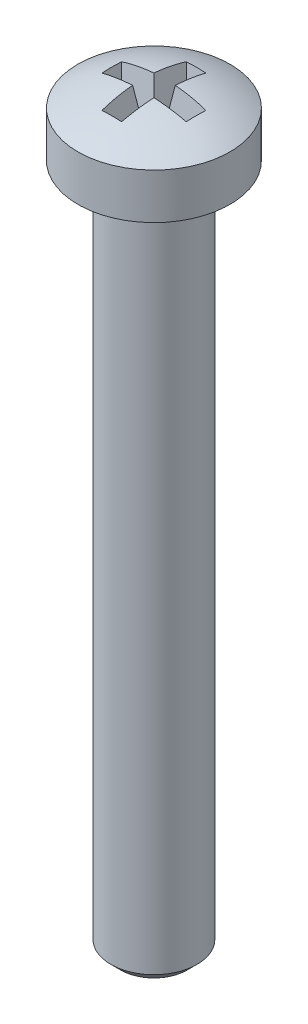
ISO-10303-21;
HEADER;
FILE_DESCRIPTION(('STEP AP214'),'2;1');
FILE_NAME('part.step','',(''),(''),'','','');
FILE_SCHEMA(('AUTOMOTIVE_DESIGN { 1 0 10303 214 1 1 1 1 }'));
ENDSEC;
DATA;
#1=APPLICATION_CONTEXT('core data for automotive mechanical design processes');
#2=APPLICATION_PROTOCOL_DEFINITION('international standard','automotive_design',2000,#1);
#3=PRODUCT_CONTEXT('',#1,'mechanical');
#4=PRODUCT('Part','Part','',(#3));
#5=PRODUCT_RELATED_PRODUCT_CATEGORY('part','',(#4));
#6=PRODUCT_DEFINITION_FORMATION('','',#4);
#7=PRODUCT_DEFINITION_CONTEXT('part definition',#1,'design');
#8=PRODUCT_DEFINITION('design','',#6,#7);
#9=PRODUCT_DEFINITION_SHAPE('','',#8);
#10=(LENGTH_UNIT() NAMED_UNIT(*) SI_UNIT(.MILLI.,.METRE.));
#11=(NAMED_UNIT(*) PLANE_ANGLE_UNIT() SI_UNIT($,.RADIAN.));
#12=(NAMED_UNIT(*) SI_UNIT($,.STERADIAN.) SOLID_ANGLE_UNIT());
#13=UNCERTAINTY_MEASURE_WITH_UNIT(LENGTH_MEASURE(1.E-05),#10,'distance_accuracy_value','');
#14=(GEOMETRIC_REPRESENTATION_CONTEXT(3) GLOBAL_UNCERTAINTY_ASSIGNED_CONTEXT((#13)) GLOBAL_UNIT_ASSIGNED_CONTEXT((#10,
#11,#12)) REPRESENTATION_CONTEXT('',''));
#15=CARTESIAN_POINT('',(0.,0.,0.));
#16=DIRECTION('',(0.,0.,1.));
#17=DIRECTION('',(1.,0.,0.));
#18=AXIS2_PLACEMENT_3D('',#15,#16,#17);
#19=CARTESIAN_POINT('',(6.,9.8,-3.3));
#20=DIRECTION('',(0.,1.,0.));
#21=DIRECTION('',(0.,0.,1.));
#22=AXIS2_PLACEMENT_3D('',#19,#20,#21);
#23=SPHERICAL_SURFACE('',#22,3.);
#24=CARTESIAN_POINT('',(6.,12.3980762113533,-3.3));
#25=DIRECTION('',(0.,1.,0.));
#26=DIRECTION('',(-1.,0.,0.));
#27=AXIS2_PLACEMENT_3D('',#24,#25,#26);
#28=CIRCLE('',#27,1.5);
#29=CARTESIAN_POINT('',(4.5,12.3980762113533,-3.3));
#30=VERTEX_POINT('',#29);
#31=EDGE_CURVE('E160',#30,#30,#28,.T.);
#32=ORIENTED_EDGE('',*,*,#31,.T.);
#33=EDGE_LOOP('',(#32));
#34=FACE_BOUND('',#33,.T.);
#35=CARTESIAN_POINT('',(6.,9.74139917848052,-3.68773769788637));
#36=DIRECTION('',(0.,-0.149438132473599,-0.988771077936042));
#37=DIRECTION('',(0.,0.988771077936042,-0.149438132473599));
#38=AXIS2_PLACEMENT_3D('',#35,#36,#37);
#39=CIRCLE('',#38,2.97426048310416);
#40=CARTESIAN_POINT('',(6.19376146307784,12.6760147557736,-4.13126146307783));
#41=VERTEX_POINT('',#40);
#42=CARTESIAN_POINT('',(5.80623853692217,12.6760147557736,-4.13126146307783));
#43=VERTEX_POINT('',#42);
#44=EDGE_CURVE('E10',#41,#43,#39,.F.);
#45=ORIENTED_EDGE('',*,*,#44,.F.);
#46=CARTESIAN_POINT('',(5.76447419197759,9.83559624435383,-3.3));
#47=DIRECTION('',(0.988771077936042,-0.149438132473599,0.));
#48=DIRECTION('',(0.149438132473599,0.988771077936042,0.));
#49=AXIS2_PLACEMENT_3D('',#46,#47,#48);
#50=CIRCLE('',#49,2.99052846519529);
#51=CARTESIAN_POINT('',(6.21026715799329,12.7852261965451,-3.51026715799328));
#52=VERTEX_POINT('',#51);
#53=EDGE_CURVE('E24',#52,#41,#50,.F.);
#54=ORIENTED_EDGE('',*,*,#53,.F.);
#55=CARTESIAN_POINT('',(6.,9.83559624435383,-3.06447419197759));
#56=DIRECTION('',(0.,-0.149438132473599,-0.988771077936042));
#57=DIRECTION('',(0.,0.988771077936042,-0.149438132473599));
#58=AXIS2_PLACEMENT_3D('',#55,#56,#57);
#59=CIRCLE('',#58,2.99052846519529);
#60=CARTESIAN_POINT('',(6.83126146307784,12.6760147557736,-3.49376146307783));
#61=VERTEX_POINT('',#60);
#62=EDGE_CURVE('E212',#61,#52,#59,.F.);
#63=ORIENTED_EDGE('',*,*,#62,.F.);
#64=CARTESIAN_POINT('',(6.38773769788638,9.74139917848052,-3.3));
#65=DIRECTION('',(0.988771077936042,-0.149438132473599,0.));
#66=DIRECTION('',(0.149438132473599,0.988771077936042,0.));
#67=AXIS2_PLACEMENT_3D('',#64,#65,#66);
#68=CIRCLE('',#67,2.97426048310416);
#69=CARTESIAN_POINT('',(6.83126146307784,12.6760147557736,-3.10623853692217));
#70=VERTEX_POINT('',#69);
#71=EDGE_CURVE('E209',#70,#61,#68,.F.);
#72=ORIENTED_EDGE('',*,*,#71,.F.);
#73=CARTESIAN_POINT('',(6.,9.83559624435383,-3.53552580802242));
#74=DIRECTION('',(0.,-0.149438132473599,0.988771077936042));
#75=DIRECTION('',(0.,-0.988771077936042,-0.149438132473599));
#76=AXIS2_PLACEMENT_3D('',#73,#74,#75);
#77=CIRCLE('',#76,2.99052846519529);
#78=CARTESIAN_POINT('',(6.21026715799329,12.7852261965451,-3.08973284200672));
#79=VERTEX_POINT('',#78);
#80=EDGE_CURVE('E206',#79,#70,#77,.F.);
#81=ORIENTED_EDGE('',*,*,#80,.F.);
#82=CARTESIAN_POINT('',(5.76447419197759,9.83559624435383,-3.3));
#83=DIRECTION('',(0.988771077936042,-0.149438132473599,0.));
#84=DIRECTION('',(0.149438132473599,0.988771077936042,0.));
#85=AXIS2_PLACEMENT_3D('',#82,#83,#84);
#86=CIRCLE('',#85,2.99052846519529);
#87=CARTESIAN_POINT('',(6.19376146307784,12.6760147557736,-2.46873853692217));
#88=VERTEX_POINT('',#87);
#89=EDGE_CURVE('E203',#88,#79,#86,.F.);
#90=ORIENTED_EDGE('',*,*,#89,.F.);
#91=CARTESIAN_POINT('',(6.,9.74139917848052,-2.91226230211362));
#92=DIRECTION('',(0.,-0.149438132473599,0.988771077936042));
#93=DIRECTION('',(0.,-0.988771077936042,-0.149438132473599));
#94=AXIS2_PLACEMENT_3D('',#91,#92,#93);
#95=CIRCLE('',#94,2.97426048310416);
#96=CARTESIAN_POINT('',(5.80623853692217,12.6760147557736,-2.46873853692217));
#97=VERTEX_POINT('',#96);
#98=EDGE_CURVE('E200',#97,#88,#95,.F.);
#99=ORIENTED_EDGE('',*,*,#98,.F.);
#100=CARTESIAN_POINT('',(6.23552580802241,9.83559624435383,-3.3));
#101=DIRECTION('',(-0.988771077936042,-0.149438132473599,0.));
#102=DIRECTION('',(0.149438132473599,-0.988771077936042,0.));
#103=AXIS2_PLACEMENT_3D('',#100,#101,#102);
#104=CIRCLE('',#103,2.99052846519529);
#105=CARTESIAN_POINT('',(5.78973284200671,12.7852261965451,-3.08973284200672));
#106=VERTEX_POINT('',#105);
#107=EDGE_CURVE('E197',#106,#97,#104,.F.);
#108=ORIENTED_EDGE('',*,*,#107,.F.);
#109=CARTESIAN_POINT('',(6.,9.83559624435383,-3.53552580802242));
#110=DIRECTION('',(0.,-0.149438132473599,0.988771077936042));
#111=DIRECTION('',(0.,-0.988771077936042,-0.149438132473599));
#112=AXIS2_PLACEMENT_3D('',#109,#110,#111);
#113=CIRCLE('',#112,2.99052846519529);
#114=CARTESIAN_POINT('',(5.16873853692217,12.6760147557736,-3.10623853692217));
#115=VERTEX_POINT('',#114);
#116=EDGE_CURVE('E194',#115,#106,#113,.F.);
#117=ORIENTED_EDGE('',*,*,#116,.F.);
#118=CARTESIAN_POINT('',(5.61226230211363,9.74139917848052,-3.3));
#119=DIRECTION('',(-0.988771077936042,-0.149438132473599,0.));
#120=DIRECTION('',(0.149438132473599,-0.988771077936042,0.));
#121=AXIS2_PLACEMENT_3D('',#118,#119,#120);
#122=CIRCLE('',#121,2.97426048310416);
#123=CARTESIAN_POINT('',(5.16873853692217,12.6760147557736,-3.49376146307783));
#124=VERTEX_POINT('',#123);
#125=EDGE_CURVE('E191',#124,#115,#122,.F.);
#126=ORIENTED_EDGE('',*,*,#125,.F.);
#127=CARTESIAN_POINT('',(6.,9.83559624435383,-3.06447419197759));
#128=DIRECTION('',(0.,-0.149438132473599,-0.988771077936042));
#129=DIRECTION('',(0.,0.988771077936042,-0.149438132473599));
#130=AXIS2_PLACEMENT_3D('',#127,#128,#129);
#131=CIRCLE('',#130,2.99052846519529);
#132=CARTESIAN_POINT('',(5.78973284200671,12.7852261965451,-3.51026715799328));
#133=VERTEX_POINT('',#132);
#134=EDGE_CURVE('E188',#133,#124,#131,.F.);
#135=ORIENTED_EDGE('',*,*,#134,.F.);
#136=CARTESIAN_POINT('',(6.23552580802242,9.83559624435383,-3.3));
#137=DIRECTION('',(-0.988771077936042,-0.149438132473599,0.));
#138=DIRECTION('',(0.149438132473599,-0.988771077936042,0.));
#139=AXIS2_PLACEMENT_3D('',#136,#137,#138);
#140=CIRCLE('',#139,2.99052846519529);
#141=EDGE_CURVE('E185',#43,#133,#140,.F.);
#142=ORIENTED_EDGE('',*,*,#141,.F.);
#143=EDGE_LOOP('',(#45,#54,#63,#72,#81,#90,#99,#108,#117,#126,#135,#142));
#144=FACE_BOUND('',#143,.T.);
#145=ADVANCED_FACE('F15',(#34,#144),#23,.T.);
#146=CARTESIAN_POINT('',(6.,-2.,-3.3));
#147=DIRECTION('',(0.,1.,0.));
#148=DIRECTION('',(-1.,0.,0.));
#149=AXIS2_PLACEMENT_3D('',#146,#147,#148);
#150=PLANE('',#149);
#151=CARTESIAN_POINT('',(6.,-2.,-3.3));
#152=DIRECTION('',(0.,1.,0.));
#153=DIRECTION('',(-1.,0.,0.));
#154=AXIS2_PLACEMENT_3D('',#151,#152,#153);
#155=CIRCLE('',#154,0.6605625);
#156=CARTESIAN_POINT('',(5.3394375,-2.,-3.3));
#157=VERTEX_POINT('',#156);
#158=EDGE_CURVE('E181',#157,#157,#155,.T.);
#159=ORIENTED_EDGE('',*,*,#158,.F.);
#160=EDGE_LOOP('',(#159));
#161=FACE_BOUND('',#160,.T.);
#162=ADVANCED_FACE('F17',(#161),#150,.F.);
#163=CARTESIAN_POINT('',(6.,-2.,-3.3));
#164=DIRECTION('',(0.,1.,0.));
#165=DIRECTION('',(-1.,0.,0.));
#166=AXIS2_PLACEMENT_3D('',#163,#164,#165);
#167=CONICAL_SURFACE('',#166,0.6605625,0.785398163397448);
#168=CARTESIAN_POINT('',(6.,-1.8105625,-3.3));
#169=DIRECTION('',(0.,1.,0.));
#170=DIRECTION('',(-1.,0.,0.));
#171=AXIS2_PLACEMENT_3D('',#168,#169,#170);
#172=CIRCLE('',#171,0.85);
#173=CARTESIAN_POINT('',(5.15,-1.8105625,-3.3));
#174=VERTEX_POINT('',#173);
#175=EDGE_CURVE('E177',#174,#174,#172,.T.);
#176=ORIENTED_EDGE('',*,*,#175,.F.);
#177=EDGE_LOOP('',(#176));
#178=FACE_BOUND('',#177,.T.);
#179=ORIENTED_EDGE('',*,*,#158,.T.);
#180=EDGE_LOOP('',(#179));
#181=FACE_BOUND('',#180,.T.);
#182=ADVANCED_FACE('F396',(#178,#181),#167,.T.);
#183=CARTESIAN_POINT('',(6.,12.8,-3.3));
#184=DIRECTION('',(0.,1.,0.));
#185=DIRECTION('',(-1.,0.,0.));
#186=AXIS2_PLACEMENT_3D('',#183,#184,#185);
#187=CYLINDRICAL_SURFACE('',#186,0.85);
#188=CARTESIAN_POINT('',(6.,11.4,-3.3));
#189=DIRECTION('',(0.,1.,0.));
#190=DIRECTION('',(-1.,0.,0.));
#191=AXIS2_PLACEMENT_3D('',#188,#189,#190);
#192=CIRCLE('',#191,0.85);
#193=CARTESIAN_POINT('',(5.15,11.4,-3.3));
#194=VERTEX_POINT('',#193);
#195=EDGE_CURVE('E173',#194,#194,#192,.T.);
#196=ORIENTED_EDGE('',*,*,#195,.F.);
#197=EDGE_LOOP('',(#196));
#198=FACE_BOUND('',#197,.T.);
#199=ORIENTED_EDGE('',*,*,#175,.T.);
#200=EDGE_LOOP('',(#199));
#201=FACE_BOUND('',#200,.T.);
#202=ADVANCED_FACE('F386',(#198,#201),#187,.T.);
#203=CARTESIAN_POINT('',(6.,11.4,-3.3));
#204=DIRECTION('',(0.,1.,0.));
#205=DIRECTION('',(-1.,0.,0.));
#206=AXIS2_PLACEMENT_3D('',#203,#204,#205);
#207=TOROIDAL_SURFACE('',#206,0.95,0.1);
#208=ORIENTED_EDGE('',*,*,#195,.T.);
#209=EDGE_LOOP('',(#208));
#210=FACE_BOUND('',#209,.T.);
#211=CARTESIAN_POINT('',(6.,11.5,-3.3));
#212=DIRECTION('',(0.,1.,0.));
#213=DIRECTION('',(-1.,0.,0.));
#214=AXIS2_PLACEMENT_3D('',#211,#212,#213);
#215=CIRCLE('',#214,0.95);
#216=CARTESIAN_POINT('',(5.05,11.5,-3.3));
#217=VERTEX_POINT('',#216);
#218=EDGE_CURVE('E169',#217,#217,#215,.T.);
#219=ORIENTED_EDGE('',*,*,#218,.F.);
#220=EDGE_LOOP('',(#219));
#221=FACE_BOUND('',#220,.T.);
#222=ADVANCED_FACE('F376',(#210,#221),#207,.F.);
#223=CARTESIAN_POINT('',(6.,11.5,-2.35));
#224=DIRECTION('',(0.,1.,0.));
#225=DIRECTION('',(-1.,0.,0.));
#226=AXIS2_PLACEMENT_3D('',#223,#224,#225);
#227=PLANE('',#226);
#228=CARTESIAN_POINT('',(6.,11.5,-3.3));
#229=DIRECTION('',(0.,1.,0.));
#230=DIRECTION('',(-1.,0.,0.));
#231=AXIS2_PLACEMENT_3D('',#228,#229,#230);
#232=CIRCLE('',#231,1.5);
#233=CARTESIAN_POINT('',(4.5,11.5,-3.3));
#234=VERTEX_POINT('',#233);
#235=EDGE_CURVE('E164',#234,#234,#232,.T.);
#236=ORIENTED_EDGE('',*,*,#235,.F.);
#237=EDGE_LOOP('',(#236));
#238=FACE_BOUND('',#237,.T.);
#239=ORIENTED_EDGE('',*,*,#218,.T.);
#240=EDGE_LOOP('',(#239));
#241=FACE_BOUND('',#240,.T.);
#242=ADVANCED_FACE('F366',(#238,#241),#227,.F.);
#243=CARTESIAN_POINT('',(6.,12.8,-3.3));
#244=DIRECTION('',(0.,1.,0.));
#245=DIRECTION('',(-1.,0.,0.));
#246=AXIS2_PLACEMENT_3D('',#243,#244,#245);
#247=CYLINDRICAL_SURFACE('',#246,1.5);
#248=ORIENTED_EDGE('',*,*,#31,.F.);
#249=EDGE_LOOP('',(#248));
#250=FACE_BOUND('',#249,.T.);
#251=ORIENTED_EDGE('',*,*,#235,.T.);
#252=EDGE_LOOP('',(#251));
#253=FACE_BOUND('',#252,.T.);
#254=ADVANCED_FACE('F357',(#250,#253),#247,.T.);
#255=CARTESIAN_POINT('',(5.7875,12.8,-4.15));
#256=DIRECTION('',(0.,-0.149438132473599,-0.988771077936042));
#257=DIRECTION('',(0.,0.988771077936042,-0.149438132473599));
#258=AXIS2_PLACEMENT_3D('',#255,#256,#257);
#259=PLANE('',#258);
#260=ORIENTED_EDGE('',*,*,#44,.T.);
#261=DIRECTION('',(-0.14779696163853,0.977912120929502,-0.14779696163853));
#262=VECTOR('',#261,1.);
#263=CARTESIAN_POINT('',(5.7875,12.8,-4.15));
#264=LINE('',#263,#262);
#265=CARTESIAN_POINT('',(5.98397578347579,11.5,-3.95352421652422));
#266=VERTEX_POINT('',#265);
#267=EDGE_CURVE('E31',#266,#43,#264,.T.);
#268=ORIENTED_EDGE('',*,*,#267,.F.);
#269=DIRECTION('',(-1.,0.,0.));
#270=VECTOR('',#269,1.);
#271=CARTESIAN_POINT('',(5.7875,11.5,-3.95352421652422));
#272=LINE('',#271,#270);
#273=CARTESIAN_POINT('',(6.01602421652422,11.5,-3.95352421652422));
#274=VERTEX_POINT('',#273);
#275=EDGE_CURVE('E117',#266,#274,#272,.F.);
#276=ORIENTED_EDGE('',*,*,#275,.T.);
#277=DIRECTION('',(0.14779696163853,0.977912120929502,-0.14779696163853));
#278=VECTOR('',#277,1.);
#279=CARTESIAN_POINT('',(6.2125,12.8,-4.15));
#280=LINE('',#279,#278);
#281=EDGE_CURVE('E165',#274,#41,#280,.T.);
#282=ORIENTED_EDGE('',*,*,#281,.T.);
#283=EDGE_LOOP('',(#260,#268,#276,#282));
#284=FACE_BOUND('',#283,.T.);
#285=ADVANCED_FACE('F116',(#284),#259,.F.);
#286=CARTESIAN_POINT('',(6.2125,12.8,-4.15));
#287=DIRECTION('',(0.988771077936042,-0.149438132473599,0.));
#288=DIRECTION('',(0.149438132473599,0.988771077936042,0.));
#289=AXIS2_PLACEMENT_3D('',#286,#287,#288);
#290=PLANE('',#289);
#291=ORIENTED_EDGE('',*,*,#53,.T.);
#292=ORIENTED_EDGE('',*,*,#281,.F.);
#293=DIRECTION('',(0.,0.,-1.));
#294=VECTOR('',#293,1.);
#295=CARTESIAN_POINT('',(6.01602421652422,11.5,-4.15));
#296=LINE('',#295,#294);
#297=CARTESIAN_POINT('',(6.01602421652422,11.5,-3.31602421652422));
#298=VERTEX_POINT('',#297);
#299=EDGE_CURVE('E124',#274,#298,#296,.F.);
#300=ORIENTED_EDGE('',*,*,#299,.T.);
#301=DIRECTION('',(0.14779696163853,0.977912120929502,-0.14779696163853));
#302=VECTOR('',#301,1.);
#303=CARTESIAN_POINT('',(6.22642551294186,12.8921394306421,-3.52642551294186));
#304=LINE('',#303,#302);
#305=EDGE_CURVE('E515',#298,#52,#304,.T.);
#306=ORIENTED_EDGE('',*,*,#305,.T.);
#307=EDGE_LOOP('',(#291,#292,#300,#306));
#308=FACE_BOUND('',#307,.T.);
#309=ADVANCED_FACE('F339',(#308),#290,.F.);
#310=CARTESIAN_POINT('',(6.2125,12.8,-3.5125));
#311=DIRECTION('',(0.,-0.149438132473599,-0.988771077936042));
#312=DIRECTION('',(0.,0.988771077936042,-0.149438132473599));
#313=AXIS2_PLACEMENT_3D('',#310,#311,#312);
#314=PLANE('',#313);
#315=ORIENTED_EDGE('',*,*,#62,.T.);
#316=ORIENTED_EDGE('',*,*,#305,.F.);
#317=DIRECTION('',(-1.,0.,0.));
#318=VECTOR('',#317,1.);
#319=CARTESIAN_POINT('',(6.2125,11.5,-3.31602421652422));
#320=LINE('',#319,#318);
#321=CARTESIAN_POINT('',(6.65352421652422,11.5,-3.31602421652422));
#322=VERTEX_POINT('',#321);
#323=EDGE_CURVE('E131',#298,#322,#320,.F.);
#324=ORIENTED_EDGE('',*,*,#323,.T.);
#325=DIRECTION('',(0.14779696163853,0.977912120929502,-0.14779696163853));
#326=VECTOR('',#325,1.);
#327=CARTESIAN_POINT('',(6.85,12.8,-3.5125));
#328=LINE('',#327,#326);
#329=EDGE_CURVE('E511',#322,#61,#328,.T.);
#330=ORIENTED_EDGE('',*,*,#329,.T.);
#331=EDGE_LOOP('',(#315,#316,#324,#330));
#332=FACE_BOUND('',#331,.T.);
#333=ADVANCED_FACE('F329',(#332),#314,.F.);
#334=CARTESIAN_POINT('',(6.85,12.8,-3.5125));
#335=DIRECTION('',(0.988771077936042,-0.149438132473599,0.));
#336=DIRECTION('',(0.149438132473599,0.988771077936042,0.));
#337=AXIS2_PLACEMENT_3D('',#334,#335,#336);
#338=PLANE('',#337);
#339=ORIENTED_EDGE('',*,*,#71,.T.);
#340=ORIENTED_EDGE('',*,*,#329,.F.);
#341=DIRECTION('',(0.,0.,-1.));
#342=VECTOR('',#341,1.);
#343=CARTESIAN_POINT('',(6.65352421652422,11.5,-3.5125));
#344=LINE('',#343,#342);
#345=CARTESIAN_POINT('',(6.65352421652422,11.5,-3.28397578347579));
#346=VERTEX_POINT('',#345);
#347=EDGE_CURVE('E137',#322,#346,#344,.F.);
#348=ORIENTED_EDGE('',*,*,#347,.T.);
#349=DIRECTION('',(0.14779696163853,0.977912120929502,0.14779696163853));
#350=VECTOR('',#349,1.);
#351=CARTESIAN_POINT('',(6.85,12.8,-3.0875));
#352=LINE('',#351,#350);
#353=EDGE_CURVE('E507',#346,#70,#352,.T.);
#354=ORIENTED_EDGE('',*,*,#353,.T.);
#355=EDGE_LOOP('',(#339,#340,#348,#354));
#356=FACE_BOUND('',#355,.T.);
#357=ADVANCED_FACE('F319',(#356),#338,.F.);
#358=CARTESIAN_POINT('',(6.85,12.8,-3.0875));
#359=DIRECTION('',(0.,-0.149438132473599,0.988771077936042));
#360=DIRECTION('',(0.,-0.988771077936042,-0.149438132473599));
#361=AXIS2_PLACEMENT_3D('',#358,#359,#360);
#362=PLANE('',#361);
#363=ORIENTED_EDGE('',*,*,#80,.T.);
#364=ORIENTED_EDGE('',*,*,#353,.F.);
#365=DIRECTION('',(1.,0.,0.));
#366=VECTOR('',#365,1.);
#367=CARTESIAN_POINT('',(6.85,11.5,-3.28397578347579));
#368=LINE('',#367,#366);
#369=CARTESIAN_POINT('',(6.01602421652422,11.5,-3.28397578347579));
#370=VERTEX_POINT('',#369);
#371=EDGE_CURVE('E140',#346,#370,#368,.F.);
#372=ORIENTED_EDGE('',*,*,#371,.T.);
#373=DIRECTION('',(0.14779696163853,0.977912120929502,0.14779696163853));
#374=VECTOR('',#373,1.);
#375=CARTESIAN_POINT('',(6.22642551294186,12.8921394306421,-3.07357448705815));
#376=LINE('',#375,#374);
#377=EDGE_CURVE('E503',#370,#79,#376,.T.);
#378=ORIENTED_EDGE('',*,*,#377,.T.);
#379=EDGE_LOOP('',(#363,#364,#372,#378));
#380=FACE_BOUND('',#379,.T.);
#381=ADVANCED_FACE('F309',(#380),#362,.F.);
#382=CARTESIAN_POINT('',(6.2125,12.8,-3.0875));
#383=DIRECTION('',(0.988771077936042,-0.149438132473599,0.));
#384=DIRECTION('',(0.149438132473599,0.988771077936042,0.));
#385=AXIS2_PLACEMENT_3D('',#382,#383,#384);
#386=PLANE('',#385);
#387=ORIENTED_EDGE('',*,*,#89,.T.);
#388=ORIENTED_EDGE('',*,*,#377,.F.);
#389=DIRECTION('',(0.,0.,-1.));
#390=VECTOR('',#389,1.);
#391=CARTESIAN_POINT('',(6.01602421652422,11.5,-3.0875));
#392=LINE('',#391,#390);
#393=CARTESIAN_POINT('',(6.01602421652422,11.5,-2.64647578347579));
#394=VERTEX_POINT('',#393);
#395=EDGE_CURVE('E143',#370,#394,#392,.F.);
#396=ORIENTED_EDGE('',*,*,#395,.T.);
#397=DIRECTION('',(0.14779696163853,0.977912120929502,0.14779696163853));
#398=VECTOR('',#397,1.);
#399=CARTESIAN_POINT('',(6.2125,12.8,-2.45));
#400=LINE('',#399,#398);
#401=EDGE_CURVE('E499',#394,#88,#400,.T.);
#402=ORIENTED_EDGE('',*,*,#401,.T.);
#403=EDGE_LOOP('',(#387,#388,#396,#402));
#404=FACE_BOUND('',#403,.T.);
#405=ADVANCED_FACE('F299',(#404),#386,.F.);
#406=CARTESIAN_POINT('',(6.2125,12.8,-2.45));
#407=DIRECTION('',(0.,-0.149438132473599,0.988771077936042));
#408=DIRECTION('',(0.,-0.988771077936042,-0.149438132473599));
#409=AXIS2_PLACEMENT_3D('',#406,#407,#408);
#410=PLANE('',#409);
#411=ORIENTED_EDGE('',*,*,#98,.T.);
#412=ORIENTED_EDGE('',*,*,#401,.F.);
#413=DIRECTION('',(1.,0.,0.));
#414=VECTOR('',#413,1.);
#415=CARTESIAN_POINT('',(6.2125,11.5,-2.64647578347579));
#416=LINE('',#415,#414);
#417=CARTESIAN_POINT('',(5.98397578347579,11.5,-2.64647578347579));
#418=VERTEX_POINT('',#417);
#419=EDGE_CURVE('E146',#394,#418,#416,.F.);
#420=ORIENTED_EDGE('',*,*,#419,.T.);
#421=DIRECTION('',(-0.14779696163853,0.977912120929502,0.14779696163853));
#422=VECTOR('',#421,1.);
#423=CARTESIAN_POINT('',(5.7875,12.8,-2.45));
#424=LINE('',#423,#422);
#425=EDGE_CURVE('E495',#418,#97,#424,.T.);
#426=ORIENTED_EDGE('',*,*,#425,.T.);
#427=EDGE_LOOP('',(#411,#412,#420,#426));
#428=FACE_BOUND('',#427,.T.);
#429=ADVANCED_FACE('F289',(#428),#410,.F.);
#430=CARTESIAN_POINT('',(5.7875,12.8,-2.45));
#431=DIRECTION('',(-0.988771077936042,-0.149438132473599,0.));
#432=DIRECTION('',(0.149438132473599,-0.988771077936042,0.));
#433=AXIS2_PLACEMENT_3D('',#430,#431,#432);
#434=PLANE('',#433);
#435=ORIENTED_EDGE('',*,*,#107,.T.);
#436=ORIENTED_EDGE('',*,*,#425,.F.);
#437=DIRECTION('',(0.,0.,1.));
#438=VECTOR('',#437,1.);
#439=CARTESIAN_POINT('',(5.98397578347579,11.5,-2.45));
#440=LINE('',#439,#438);
#441=CARTESIAN_POINT('',(5.98397578347579,11.5,-3.28397578347579));
#442=VERTEX_POINT('',#441);
#443=EDGE_CURVE('E149',#418,#442,#440,.F.);
#444=ORIENTED_EDGE('',*,*,#443,.T.);
#445=DIRECTION('',(-0.14779696163853,0.977912120929502,0.14779696163853));
#446=VECTOR('',#445,1.);
#447=CARTESIAN_POINT('',(5.77357448705814,12.8921394306421,-3.07357448705815));
#448=LINE('',#447,#446);
#449=EDGE_CURVE('E491',#442,#106,#448,.T.);
#450=ORIENTED_EDGE('',*,*,#449,.T.);
#451=EDGE_LOOP('',(#435,#436,#444,#450));
#452=FACE_BOUND('',#451,.T.);
#453=ADVANCED_FACE('F279',(#452),#434,.F.);
#454=CARTESIAN_POINT('',(5.7875,12.8,-3.0875));
#455=DIRECTION('',(0.,-0.149438132473599,0.988771077936042));
#456=DIRECTION('',(0.,-0.988771077936042,-0.149438132473599));
#457=AXIS2_PLACEMENT_3D('',#454,#455,#456);
#458=PLANE('',#457);
#459=ORIENTED_EDGE('',*,*,#116,.T.);
#460=ORIENTED_EDGE('',*,*,#449,.F.);
#461=DIRECTION('',(1.,0.,0.));
#462=VECTOR('',#461,1.);
#463=CARTESIAN_POINT('',(5.7875,11.5,-3.28397578347579));
#464=LINE('',#463,#462);
#465=CARTESIAN_POINT('',(5.34647578347579,11.5,-3.28397578347579));
#466=VERTEX_POINT('',#465);
#467=EDGE_CURVE('E152',#442,#466,#464,.F.);
#468=ORIENTED_EDGE('',*,*,#467,.T.);
#469=DIRECTION('',(-0.14779696163853,0.977912120929502,0.14779696163853));
#470=VECTOR('',#469,1.);
#471=CARTESIAN_POINT('',(5.15,12.8,-3.0875));
#472=LINE('',#471,#470);
#473=EDGE_CURVE('E485',#466,#115,#472,.T.);
#474=ORIENTED_EDGE('',*,*,#473,.T.);
#475=EDGE_LOOP('',(#459,#460,#468,#474));
#476=FACE_BOUND('',#475,.T.);
#477=ADVANCED_FACE('F269',(#476),#458,.F.);
#478=CARTESIAN_POINT('',(5.15,12.8,-3.0875));
#479=DIRECTION('',(-0.988771077936042,-0.149438132473599,0.));
#480=DIRECTION('',(0.149438132473599,-0.988771077936042,0.));
#481=AXIS2_PLACEMENT_3D('',#478,#479,#480);
#482=PLANE('',#481);
#483=ORIENTED_EDGE('',*,*,#125,.T.);
#484=ORIENTED_EDGE('',*,*,#473,.F.);
#485=DIRECTION('',(0.,0.,1.));
#486=VECTOR('',#485,1.);
#487=CARTESIAN_POINT('',(5.34647578347579,11.5,-3.0875));
#488=LINE('',#487,#486);
#489=CARTESIAN_POINT('',(5.34647578347579,11.5,-3.31602421652422));
#490=VERTEX_POINT('',#489);
#491=EDGE_CURVE('E155',#466,#490,#488,.F.);
#492=ORIENTED_EDGE('',*,*,#491,.T.);
#493=DIRECTION('',(-0.14779696163853,0.977912120929502,-0.14779696163853));
#494=VECTOR('',#493,1.);
#495=CARTESIAN_POINT('',(5.15,12.8,-3.5125));
#496=LINE('',#495,#494);
#497=EDGE_CURVE('E481',#490,#124,#496,.T.);
#498=ORIENTED_EDGE('',*,*,#497,.T.);
#499=EDGE_LOOP('',(#483,#484,#492,#498));
#500=FACE_BOUND('',#499,.T.);
#501=ADVANCED_FACE('F259',(#500),#482,.F.);
#502=CARTESIAN_POINT('',(5.15,12.8,-3.5125));
#503=DIRECTION('',(0.,-0.149438132473599,-0.988771077936042));
#504=DIRECTION('',(0.,0.988771077936042,-0.149438132473599));
#505=AXIS2_PLACEMENT_3D('',#502,#503,#504);
#506=PLANE('',#505);
#507=ORIENTED_EDGE('',*,*,#134,.T.);
#508=ORIENTED_EDGE('',*,*,#497,.F.);
#509=DIRECTION('',(-1.,0.,0.));
#510=VECTOR('',#509,1.);
#511=CARTESIAN_POINT('',(5.15,11.5,-3.31602421652422));
#512=LINE('',#511,#510);
#513=CARTESIAN_POINT('',(5.98397578347579,11.5,-3.31602421652422));
#514=VERTEX_POINT('',#513);
#515=EDGE_CURVE('E112',#490,#514,#512,.F.);
#516=ORIENTED_EDGE('',*,*,#515,.T.);
#517=DIRECTION('',(-0.14779696163853,0.977912120929502,-0.14779696163853));
#518=VECTOR('',#517,1.);
#519=CARTESIAN_POINT('',(5.77357448705814,12.8921394306421,-3.52642551294186));
#520=LINE('',#519,#518);
#521=EDGE_CURVE('E107',#514,#133,#520,.T.);
#522=ORIENTED_EDGE('',*,*,#521,.T.);
#523=EDGE_LOOP('',(#507,#508,#516,#522));
#524=FACE_BOUND('',#523,.T.);
#525=ADVANCED_FACE('F250',(#524),#506,.F.);
#526=CARTESIAN_POINT('',(5.7875,12.8,-3.5125));
#527=DIRECTION('',(-0.988771077936042,-0.149438132473599,0.));
#528=DIRECTION('',(0.149438132473599,-0.988771077936042,0.));
#529=AXIS2_PLACEMENT_3D('',#526,#527,#528);
#530=PLANE('',#529);
#531=ORIENTED_EDGE('',*,*,#141,.T.);
#532=ORIENTED_EDGE('',*,*,#521,.F.);
#533=DIRECTION('',(0.,0.,1.));
#534=VECTOR('',#533,1.);
#535=CARTESIAN_POINT('',(5.98397578347579,11.5,-3.5125));
#536=LINE('',#535,#534);
#537=EDGE_CURVE('E104',#514,#266,#536,.F.);
#538=ORIENTED_EDGE('',*,*,#537,.T.);
#539=ORIENTED_EDGE('',*,*,#267,.T.);
#540=EDGE_LOOP('',(#531,#532,#538,#539));
#541=FACE_BOUND('',#540,.T.);
#542=ADVANCED_FACE('F105',(#541),#530,.F.);
#543=CARTESIAN_POINT('',(6.2125,11.5,-4.15));
#544=DIRECTION('',(0.,-1.,0.));
#545=DIRECTION('',(1.,0.,0.));
#546=AXIS2_PLACEMENT_3D('',#543,#544,#545);
#547=PLANE('',#546);
#548=ORIENTED_EDGE('',*,*,#275,.F.);
#549=ORIENTED_EDGE('',*,*,#537,.F.);
#550=ORIENTED_EDGE('',*,*,#515,.F.);
#551=ORIENTED_EDGE('',*,*,#491,.F.);
#552=ORIENTED_EDGE('',*,*,#467,.F.);
#553=ORIENTED_EDGE('',*,*,#443,.F.);
#554=ORIENTED_EDGE('',*,*,#419,.F.);
#555=ORIENTED_EDGE('',*,*,#395,.F.);
#556=ORIENTED_EDGE('',*,*,#371,.F.);
#557=ORIENTED_EDGE('',*,*,#347,.F.);
#558=ORIENTED_EDGE('',*,*,#323,.F.);
#559=ORIENTED_EDGE('',*,*,#299,.F.);
#560=EDGE_LOOP('',(#548,#549,#550,#551,#552,#553,#554,#555,#556,#557,#558,#559));
#561=FACE_BOUND('',#560,.T.);
#562=ADVANCED_FACE('F122',(#561),#547,.F.);
#563=CLOSED_SHELL('',(#145,#162,#182,#202,#222,#242,#254,#285,#309,#333,#357,#381,#405,#429,
#453,#477,#501,#525,#542,#562));
#564=MANIFOLD_SOLID_BREP('B1',#563);
#565=ADVANCED_BREP_SHAPE_REPRESENTATION('',(#18,#564),#14);
#566=SHAPE_DEFINITION_REPRESENTATION(#9,#565);
ENDSEC;
END-ISO-10303-21;
